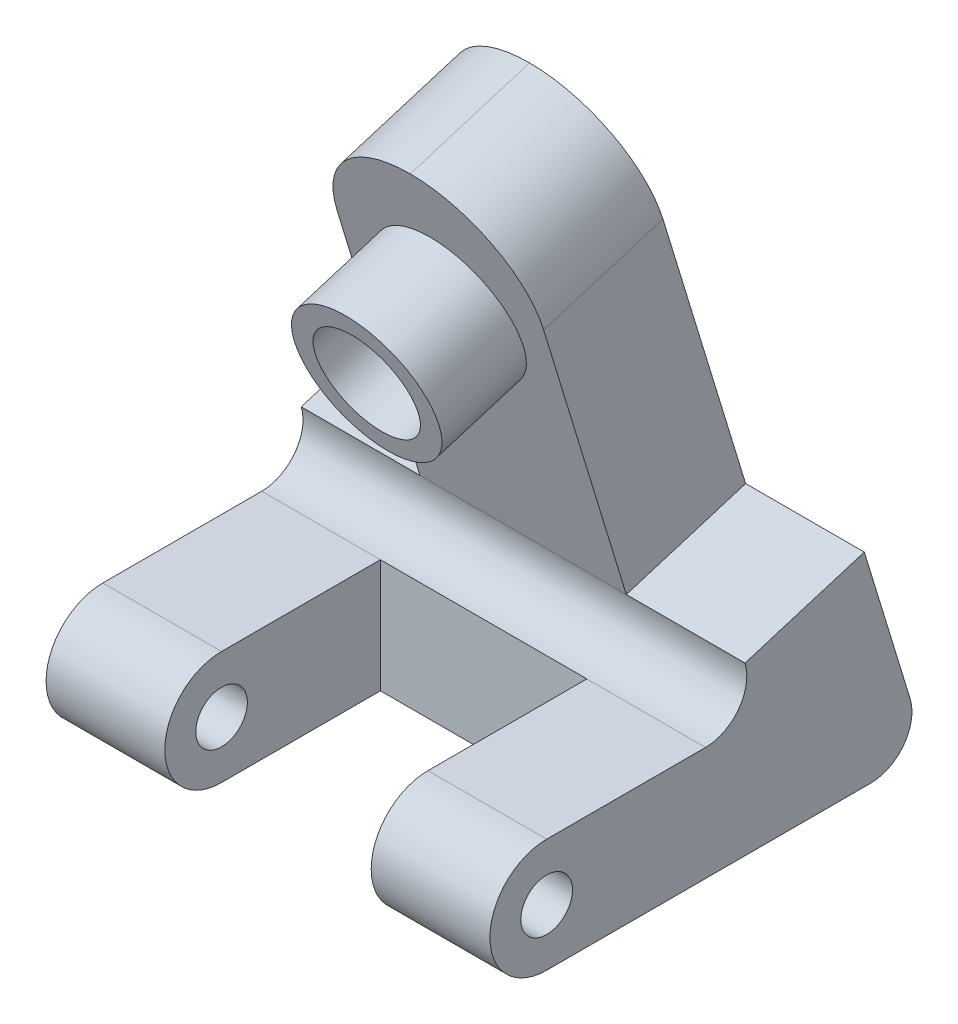
ISO-10303-21;
HEADER;
FILE_DESCRIPTION(('STEP AP214'),'2;1');
FILE_NAME('part.step','',(''),(''),'','','');
FILE_SCHEMA(('AUTOMOTIVE_DESIGN { 1 0 10303 214 1 1 1 1 }'));
ENDSEC;
DATA;
#1=APPLICATION_CONTEXT('core data for automotive mechanical design processes');
#2=APPLICATION_PROTOCOL_DEFINITION('international standard','automotive_design',2000,#1);
#3=PRODUCT_CONTEXT('',#1,'mechanical');
#4=PRODUCT('Part','Part','',(#3));
#5=PRODUCT_RELATED_PRODUCT_CATEGORY('part','',(#4));
#6=PRODUCT_DEFINITION_FORMATION('','',#4);
#7=PRODUCT_DEFINITION_CONTEXT('part definition',#1,'design');
#8=PRODUCT_DEFINITION('design','',#6,#7);
#9=PRODUCT_DEFINITION_SHAPE('','',#8);
#10=(LENGTH_UNIT() NAMED_UNIT(*) SI_UNIT(.MILLI.,.METRE.));
#11=(NAMED_UNIT(*) PLANE_ANGLE_UNIT() SI_UNIT($,.RADIAN.));
#12=(NAMED_UNIT(*) SI_UNIT($,.STERADIAN.) SOLID_ANGLE_UNIT());
#13=UNCERTAINTY_MEASURE_WITH_UNIT(LENGTH_MEASURE(1.E-05),#10,'distance_accuracy_value','');
#14=(GEOMETRIC_REPRESENTATION_CONTEXT(3) GLOBAL_UNCERTAINTY_ASSIGNED_CONTEXT((#13)) GLOBAL_UNIT_ASSIGNED_CONTEXT((#10,
#11,#12)) REPRESENTATION_CONTEXT('',''));
#15=CARTESIAN_POINT('',(0.,0.,0.));
#16=DIRECTION('',(0.,0.,1.));
#17=DIRECTION('',(1.,0.,0.));
#18=AXIS2_PLACEMENT_3D('',#15,#16,#17);
#19=CARTESIAN_POINT('',(20.0025,6.77512412999574,-30.4784538193964));
#20=DIRECTION('',(1.,0.,0.));
#21=DIRECTION('',(0.,0.,-1.));
#22=AXIS2_PLACEMENT_3D('',#19,#20,#21);
#23=PLANE('',#22);
#24=CARTESIAN_POINT('',(20.0025,0.,0.));
#25=DIRECTION('',(1.,0.,0.));
#26=DIRECTION('',(0.,0.,-1.));
#27=AXIS2_PLACEMENT_3D('',#24,#25,#26);
#28=CIRCLE('',#27,1.5875);
#29=CARTESIAN_POINT('',(20.0025,0.,-1.5875));
#30=VERTEX_POINT('',#29);
#31=EDGE_CURVE('E262',#30,#30,#28,.T.);
#32=ORIENTED_EDGE('',*,*,#31,.T.);
#33=EDGE_LOOP('',(#32));
#34=FACE_BOUND('',#33,.T.);
#35=DIRECTION('',(0.,1.,0.));
#36=VECTOR('',#35,1.);
#37=CARTESIAN_POINT('',(20.0025,3.4925,-9.77538700761766));
#38=LINE('',#37,#36);
#39=CARTESIAN_POINT('',(20.0025,-3.4925,-9.77538700761767));
#40=VERTEX_POINT('',#39);
#41=CARTESIAN_POINT('',(20.0025,3.4925,-9.77538700761766));
#42=VERTEX_POINT('',#41);
#43=EDGE_CURVE('E175',#40,#42,#38,.T.);
#44=ORIENTED_EDGE('',*,*,#43,.F.);
#45=DIRECTION('',(0.,0.,1.));
#46=VECTOR('',#45,1.);
#47=CARTESIAN_POINT('',(20.0025,-3.4925,-30.4784538193964));
#48=LINE('',#47,#46);
#49=CARTESIAN_POINT('',(20.0025,-3.4925,0.));
#50=VERTEX_POINT('',#49);
#51=EDGE_CURVE('E165',#40,#50,#48,.T.);
#52=ORIENTED_EDGE('',*,*,#51,.T.);
#53=CARTESIAN_POINT('',(20.0025,0.,0.));
#54=DIRECTION('',(1.,0.,0.));
#55=DIRECTION('',(0.,0.,-1.));
#56=AXIS2_PLACEMENT_3D('',#53,#54,#55);
#57=CIRCLE('',#56,3.4925);
#58=CARTESIAN_POINT('',(20.0025,3.4925,0.));
#59=VERTEX_POINT('',#58);
#60=EDGE_CURVE('E258',#59,#50,#57,.T.);
#61=ORIENTED_EDGE('',*,*,#60,.F.);
#62=DIRECTION('',(0.,0.,1.));
#63=VECTOR('',#62,1.);
#64=CARTESIAN_POINT('',(20.0025,3.4925,0.));
#65=LINE('',#64,#63);
#66=EDGE_CURVE('E254',#42,#59,#65,.T.);
#67=ORIENTED_EDGE('',*,*,#66,.F.);
#68=EDGE_LOOP('',(#44,#52,#61,#67));
#69=FACE_BOUND('',#68,.T.);
#70=ADVANCED_FACE('F43',(#34,#69),#23,.F.);
#71=CARTESIAN_POINT('',(7.3025,6.77512412999574,-30.4784538193964));
#72=DIRECTION('',(-1.,0.,0.));
#73=DIRECTION('',(0.,0.,1.));
#74=AXIS2_PLACEMENT_3D('',#71,#72,#73);
#75=PLANE('',#74);
#76=CARTESIAN_POINT('',(7.3025,0.,0.));
#77=DIRECTION('',(-1.,0.,0.));
#78=DIRECTION('',(0.,0.,1.));
#79=AXIS2_PLACEMENT_3D('',#76,#77,#78);
#80=CIRCLE('',#79,1.5875);
#81=CARTESIAN_POINT('',(7.3025,0.,1.5875));
#82=VERTEX_POINT('',#81);
#83=EDGE_CURVE('E250',#82,#82,#80,.T.);
#84=ORIENTED_EDGE('',*,*,#83,.T.);
#85=EDGE_LOOP('',(#84));
#86=FACE_BOUND('',#85,.T.);
#87=DIRECTION('',(0.,1.,0.));
#88=VECTOR('',#87,1.);
#89=CARTESIAN_POINT('',(7.3025,3.4925,-9.77538700761766));
#90=LINE('',#89,#88);
#91=CARTESIAN_POINT('',(7.3025,-3.4925,-9.77538700761766));
#92=VERTEX_POINT('',#91);
#93=CARTESIAN_POINT('',(7.3025,3.4925,-9.77538700761766));
#94=VERTEX_POINT('',#93);
#95=EDGE_CURVE('E158',#92,#94,#90,.T.);
#96=ORIENTED_EDGE('',*,*,#95,.T.);
#97=DIRECTION('',(0.,0.,-1.));
#98=VECTOR('',#97,1.);
#99=CARTESIAN_POINT('',(7.3025,3.4925,0.));
#100=LINE('',#99,#98);
#101=CARTESIAN_POINT('',(7.3025,3.4925,0.));
#102=VERTEX_POINT('',#101);
#103=EDGE_CURVE('E164',#102,#94,#100,.T.);
#104=ORIENTED_EDGE('',*,*,#103,.F.);
#105=CARTESIAN_POINT('',(7.3025,0.,0.));
#106=DIRECTION('',(-1.,0.,0.));
#107=DIRECTION('',(0.,0.,1.));
#108=AXIS2_PLACEMENT_3D('',#105,#106,#107);
#109=CIRCLE('',#108,3.4925);
#110=CARTESIAN_POINT('',(7.3025,-3.4925,0.));
#111=VERTEX_POINT('',#110);
#112=EDGE_CURVE('E160',#111,#102,#109,.T.);
#113=ORIENTED_EDGE('',*,*,#112,.F.);
#114=DIRECTION('',(0.,0.,1.));
#115=VECTOR('',#114,1.);
#116=CARTESIAN_POINT('',(7.3025,-3.4925,-30.4784538193964));
#117=LINE('',#116,#115);
#118=EDGE_CURVE('E153',#92,#111,#117,.T.);
#119=ORIENTED_EDGE('',*,*,#118,.F.);
#120=EDGE_LOOP('',(#96,#104,#113,#119));
#121=FACE_BOUND('',#120,.T.);
#122=ADVANCED_FACE('F155',(#86,#121),#75,.F.);
#123=CARTESIAN_POINT('',(27.305,3.4925,-13.208));
#124=DIRECTION('',(0.,0.292371704722731,-0.956304755963037));
#125=DIRECTION('',(0.,0.956304755963037,0.292371704722731));
#126=AXIS2_PLACEMENT_3D('',#123,#124,#125);
#127=PLANE('',#126);
#128=CARTESIAN_POINT('',(13.6525,21.2566992799276,-7.77693924858039));
#129=DIRECTION('',(0.,0.292371704722731,-0.956304755963037));
#130=DIRECTION('',(0.,0.956304755963037,0.292371704722731));
#131=AXIS2_PLACEMENT_3D('',#128,#129,#130);
#132=CIRCLE('',#131,4.44499999999998);
#133=CARTESIAN_POINT('',(13.6525,25.5074739201833,-6.47734702108786));
#134=VERTEX_POINT('',#133);
#135=EDGE_CURVE('E344',#134,#134,#132,.F.);
#136=ORIENTED_EDGE('',*,*,#135,.F.);
#137=EDGE_LOOP('',(#136));
#138=FACE_BOUND('',#137,.T.);
#139=DIRECTION('',(0.,0.956304755963037,0.292371704722731));
#140=VECTOR('',#139,1.);
#141=CARTESIAN_POINT('',(20.0025,29.4845904903388,-5.26142046185372));
#142=LINE('',#141,#140);
#143=CARTESIAN_POINT('',(20.0025,6.77512412999574,-12.2044010877638));
#144=VERTEX_POINT('',#143);
#145=CARTESIAN_POINT('',(20.0025,23.4120552899735,-7.11798078684306));
#146=VERTEX_POINT('',#145);
#147=EDGE_CURVE('E195',#144,#146,#142,.T.);
#148=ORIENTED_EDGE('',*,*,#147,.T.);
#149=CARTESIAN_POINT('',(13.6525,23.4120552899735,-7.11798078684306));
#150=DIRECTION('',(0.,0.292371704722731,-0.956304755963037));
#151=DIRECTION('',(0.,0.956304755963037,0.292371704722731));
#152=AXIS2_PLACEMENT_3D('',#149,#150,#151);
#153=CIRCLE('',#152,6.35);
#154=CARTESIAN_POINT('',(13.6525,29.4845904903388,-5.26142046185372));
#155=VERTEX_POINT('',#154);
#156=EDGE_CURVE('E53',#146,#155,#153,.F.);
#157=ORIENTED_EDGE('',*,*,#156,.T.);
#158=CARTESIAN_POINT('',(13.6525,23.4120552899735,-7.11798078684306));
#159=DIRECTION('',(0.,0.292371704722731,-0.956304755963037));
#160=DIRECTION('',(0.,0.956304755963037,0.292371704722731));
#161=AXIS2_PLACEMENT_3D('',#158,#159,#160);
#162=CIRCLE('',#161,6.35);
#163=CARTESIAN_POINT('',(7.3025,23.4120552899735,-7.11798078684306));
#164=VERTEX_POINT('',#163);
#165=EDGE_CURVE('E63',#155,#164,#162,.F.);
#166=ORIENTED_EDGE('',*,*,#165,.T.);
#167=DIRECTION('',(0.,-0.956304755963037,-0.292371704722731));
#168=VECTOR('',#167,1.);
#169=CARTESIAN_POINT('',(7.3025,29.4845904903388,-5.26142046185372));
#170=LINE('',#169,#168);
#171=CARTESIAN_POINT('',(7.3025,6.77512412999574,-12.2044010877638));
#172=VERTEX_POINT('',#171);
#173=EDGE_CURVE('E209',#164,#172,#170,.T.);
#174=ORIENTED_EDGE('',*,*,#173,.T.);
#175=DIRECTION('',(1.,0.,0.));
#176=VECTOR('',#175,1.);
#177=CARTESIAN_POINT('',(-4.37775292560834,6.77512412999574,-12.2044010877638));
#178=LINE('',#177,#176);
#179=EDGE_CURVE('E176',#172,#144,#178,.T.);
#180=ORIENTED_EDGE('',*,*,#179,.T.);
#181=EDGE_LOOP('',(#148,#157,#166,#174,#180));
#182=FACE_BOUND('',#181,.T.);
#183=ADVANCED_FACE('F426',(#138,#182),#127,.F.);
#184=CARTESIAN_POINT('',(27.305,0.,0.));
#185=DIRECTION('',(-1.,0.,0.));
#186=DIRECTION('',(0.,0.,1.));
#187=AXIS2_PLACEMENT_3D('',#184,#185,#186);
#188=CYLINDRICAL_SURFACE('',#187,3.4925);
#189=ORIENTED_EDGE('',*,*,#112,.T.);
#190=DIRECTION('',(-1.,0.,0.));
#191=VECTOR('',#190,1.);
#192=CARTESIAN_POINT('',(27.305,3.4925,0.));
#193=LINE('',#192,#191);
#194=CARTESIAN_POINT('',(0.,3.4925,0.));
#195=VERTEX_POINT('',#194);
#196=EDGE_CURVE('E291',#102,#195,#193,.T.);
#197=ORIENTED_EDGE('',*,*,#196,.T.);
#198=CARTESIAN_POINT('',(0.,0.,0.));
#199=DIRECTION('',(1.,0.,0.));
#200=DIRECTION('',(0.,0.,-1.));
#201=AXIS2_PLACEMENT_3D('',#198,#199,#200);
#202=CIRCLE('',#201,3.4925);
#203=CARTESIAN_POINT('',(0.,-3.4925,0.));
#204=VERTEX_POINT('',#203);
#205=EDGE_CURVE('E271',#195,#204,#202,.T.);
#206=ORIENTED_EDGE('',*,*,#205,.T.);
#207=DIRECTION('',(-1.,0.,0.));
#208=VECTOR('',#207,1.);
#209=CARTESIAN_POINT('',(27.305,-3.4925,0.));
#210=LINE('',#209,#208);
#211=EDGE_CURVE('E310',#111,#204,#210,.T.);
#212=ORIENTED_EDGE('',*,*,#211,.F.);
#213=EDGE_LOOP('',(#189,#197,#206,#212));
#214=FACE_BOUND('',#213,.T.);
#215=ADVANCED_FACE('F367',(#214),#188,.T.);
#216=CARTESIAN_POINT('',(27.305,3.4925,0.));
#217=DIRECTION('',(0.,-1.,0.));
#218=DIRECTION('',(0.,0.,-1.));
#219=AXIS2_PLACEMENT_3D('',#216,#217,#218);
#220=PLANE('',#219);
#221=DIRECTION('',(-1.,0.,0.));
#222=VECTOR('',#221,1.);
#223=CARTESIAN_POINT('',(0.,3.4925,-9.77538700761766));
#224=LINE('',#223,#222);
#225=CARTESIAN_POINT('',(27.305,3.4925,-9.77538700761766));
#226=VERTEX_POINT('',#225);
#227=EDGE_CURVE('E315',#226,#42,#224,.T.);
#228=ORIENTED_EDGE('',*,*,#227,.T.);
#229=ORIENTED_EDGE('',*,*,#66,.T.);
#230=CARTESIAN_POINT('',(27.305,3.4925,0.));
#231=VERTEX_POINT('',#230);
#232=EDGE_CURVE('E306',#231,#59,#193,.T.);
#233=ORIENTED_EDGE('',*,*,#232,.F.);
#234=DIRECTION('',(0.,0.,1.));
#235=VECTOR('',#234,1.);
#236=CARTESIAN_POINT('',(27.305,3.4925,0.));
#237=LINE('',#236,#235);
#238=EDGE_CURVE('E288',#226,#231,#237,.T.);
#239=ORIENTED_EDGE('',*,*,#238,.F.);
#240=EDGE_LOOP('',(#228,#229,#233,#239));
#241=FACE_BOUND('',#240,.T.);
#242=ADVANCED_FACE('F410',(#241),#220,.F.);
#243=CARTESIAN_POINT('',(27.305,0.,0.));
#244=DIRECTION('',(-1.,0.,0.));
#245=DIRECTION('',(0.,0.,1.));
#246=AXIS2_PLACEMENT_3D('',#243,#244,#245);
#247=CYLINDRICAL_SURFACE('',#246,1.5875);
#248=ORIENTED_EDGE('',*,*,#31,.F.);
#249=EDGE_LOOP('',(#248));
#250=FACE_BOUND('',#249,.T.);
#251=CARTESIAN_POINT('',(27.305,0.,0.));
#252=DIRECTION('',(1.,0.,0.));
#253=DIRECTION('',(0.,0.,-1.));
#254=AXIS2_PLACEMENT_3D('',#251,#252,#253);
#255=CIRCLE('',#254,1.5875);
#256=CARTESIAN_POINT('',(27.305,0.,-1.5875));
#257=VERTEX_POINT('',#256);
#258=EDGE_CURVE('E267',#257,#257,#255,.T.);
#259=ORIENTED_EDGE('',*,*,#258,.T.);
#260=EDGE_LOOP('',(#259));
#261=FACE_BOUND('',#260,.T.);
#262=ADVANCED_FACE('F441',(#250,#261),#247,.F.);
#263=CARTESIAN_POINT('',(27.305,0.,0.));
#264=DIRECTION('',(1.,0.,0.));
#265=DIRECTION('',(0.,0.,-1.));
#266=AXIS2_PLACEMENT_3D('',#263,#264,#265);
#267=PLANE('',#266);
#268=DIRECTION('',(0.,0.292371704722731,-0.956304755963037));
#269=VECTOR('',#268,1.);
#270=CARTESIAN_POINT('',(27.305,6.77512412999574,-12.2044010877638));
#271=LINE('',#270,#269);
#272=CARTESIAN_POINT('',(27.305,6.77512412999574,-12.2044010877638));
#273=VERTEX_POINT('',#272);
#274=CARTESIAN_POINT('',(27.305,9.01873780177559,-19.5429307409719));
#275=VERTEX_POINT('',#274);
#276=EDGE_CURVE('E183',#273,#275,#271,.T.);
#277=ORIENTED_EDGE('',*,*,#276,.F.);
#278=CARTESIAN_POINT('',(27.305,6.0325,-9.77538700761766));
#279=DIRECTION('',(1.,0.,0.));
#280=DIRECTION('',(0.,0.,-1.));
#281=AXIS2_PLACEMENT_3D('',#278,#279,#280);
#282=CIRCLE('',#281,2.54);
#283=EDGE_CURVE('E341',#273,#226,#282,.F.);
#284=ORIENTED_EDGE('',*,*,#283,.T.);
#285=ORIENTED_EDGE('',*,*,#238,.T.);
#286=CARTESIAN_POINT('',(27.305,0.,0.));
#287=DIRECTION('',(1.,0.,0.));
#288=DIRECTION('',(0.,0.,-1.));
#289=AXIS2_PLACEMENT_3D('',#286,#287,#288);
#290=CIRCLE('',#289,3.4925);
#291=CARTESIAN_POINT('',(27.305,-3.4925,0.));
#292=VERTEX_POINT('',#291);
#293=EDGE_CURVE('E275',#231,#292,#290,.T.);
#294=ORIENTED_EDGE('',*,*,#293,.T.);
#295=DIRECTION('',(0.,0.,-1.));
#296=VECTOR('',#295,1.);
#297=CARTESIAN_POINT('',(27.305,-3.4925,0.));
#298=LINE('',#297,#296);
#299=CARTESIAN_POINT('',(27.305,-3.4925,-19.9353870076177));
#300=VERTEX_POINT('',#299);
#301=EDGE_CURVE('E279',#292,#300,#298,.T.);
#302=ORIENTED_EDGE('',*,*,#301,.T.);
#303=CARTESIAN_POINT('',(27.305,-0.9525,-19.9353870076177));
#304=DIRECTION('',(1.,0.,0.));
#305=DIRECTION('',(0.,0.,-1.));
#306=AXIS2_PLACEMENT_3D('',#303,#304,#305);
#307=CIRCLE('',#306,2.54);
#308=CARTESIAN_POINT('',(27.305,-0.209875870004263,-22.3644010877638));
#309=VERTEX_POINT('',#308);
#310=EDGE_CURVE('E334',#300,#309,#307,.T.);
#311=ORIENTED_EDGE('',*,*,#310,.T.);
#312=DIRECTION('',(0.,0.956304755963037,0.292371704722731));
#313=VECTOR('',#312,1.);
#314=CARTESIAN_POINT('',(27.305,-3.4925,-23.368));
#315=LINE('',#314,#313);
#316=EDGE_CURVE('E284',#309,#275,#315,.T.);
#317=ORIENTED_EDGE('',*,*,#316,.T.);
#318=EDGE_LOOP('',(#277,#284,#285,#294,#302,#311,#317));
#319=FACE_BOUND('',#318,.T.);
#320=ORIENTED_EDGE('',*,*,#258,.F.);
#321=EDGE_LOOP('',(#320));
#322=FACE_BOUND('',#321,.T.);
#323=ADVANCED_FACE('F387',(#319,#322),#267,.T.);
#324=CARTESIAN_POINT('',(0.,0.,0.));
#325=DIRECTION('',(1.,0.,0.));
#326=DIRECTION('',(0.,0.,-1.));
#327=AXIS2_PLACEMENT_3D('',#324,#325,#326);
#328=PLANE('',#327);
#329=CARTESIAN_POINT('',(0.,6.0325,-9.77538700761766));
#330=DIRECTION('',(1.,0.,0.));
#331=DIRECTION('',(0.,0.,-1.));
#332=AXIS2_PLACEMENT_3D('',#329,#330,#331);
#333=CIRCLE('',#332,2.54);
#334=CARTESIAN_POINT('',(0.,3.4925,-9.77538700761766));
#335=VERTEX_POINT('',#334);
#336=CARTESIAN_POINT('',(0.,6.77512412999574,-12.2044010877638));
#337=VERTEX_POINT('',#336);
#338=EDGE_CURVE('E337',#335,#337,#333,.T.);
#339=ORIENTED_EDGE('',*,*,#338,.T.);
#340=DIRECTION('',(0.,-0.292371704722731,0.956304755963037));
#341=VECTOR('',#340,1.);
#342=CARTESIAN_POINT('',(0.,6.77512412999574,-12.2044010877638));
#343=LINE('',#342,#341);
#344=CARTESIAN_POINT('',(0.,9.01873780177559,-19.5429307409719));
#345=VERTEX_POINT('',#344);
#346=EDGE_CURVE('E204',#345,#337,#343,.T.);
#347=ORIENTED_EDGE('',*,*,#346,.F.);
#348=DIRECTION('',(0.,0.956304755963037,0.292371704722731));
#349=VECTOR('',#348,1.);
#350=CARTESIAN_POINT('',(0.,-3.4925,-23.368));
#351=LINE('',#350,#349);
#352=CARTESIAN_POINT('',(0.,-0.209875870004263,-22.3644010877638));
#353=VERTEX_POINT('',#352);
#354=EDGE_CURVE('E299',#353,#345,#351,.T.);
#355=ORIENTED_EDGE('',*,*,#354,.F.);
#356=CARTESIAN_POINT('',(0.,-0.9525,-19.9353870076177));
#357=DIRECTION('',(1.,0.,0.));
#358=DIRECTION('',(0.,0.,-1.));
#359=AXIS2_PLACEMENT_3D('',#356,#357,#358);
#360=CIRCLE('',#359,2.54);
#361=CARTESIAN_POINT('',(0.,-3.4925,-19.9353870076177));
#362=VERTEX_POINT('',#361);
#363=EDGE_CURVE('E328',#353,#362,#360,.F.);
#364=ORIENTED_EDGE('',*,*,#363,.T.);
#365=DIRECTION('',(0.,0.,-1.));
#366=VECTOR('',#365,1.);
#367=CARTESIAN_POINT('',(0.,-3.4925,0.));
#368=LINE('',#367,#366);
#369=EDGE_CURVE('E295',#204,#362,#368,.T.);
#370=ORIENTED_EDGE('',*,*,#369,.F.);
#371=ORIENTED_EDGE('',*,*,#205,.F.);
#372=DIRECTION('',(0.,0.,1.));
#373=VECTOR('',#372,1.);
#374=CARTESIAN_POINT('',(0.,3.4925,0.));
#375=LINE('',#374,#373);
#376=EDGE_CURVE('E280',#335,#195,#375,.T.);
#377=ORIENTED_EDGE('',*,*,#376,.F.);
#378=EDGE_LOOP('',(#339,#347,#355,#364,#370,#371,#377));
#379=FACE_BOUND('',#378,.T.);
#380=CARTESIAN_POINT('',(0.,0.,0.));
#381=DIRECTION('',(1.,0.,0.));
#382=DIRECTION('',(0.,0.,-1.));
#383=AXIS2_PLACEMENT_3D('',#380,#381,#382);
#384=CIRCLE('',#383,1.5875);
#385=CARTESIAN_POINT('',(0.,0.,-1.5875));
#386=VERTEX_POINT('',#385);
#387=EDGE_CURVE('E266',#386,#386,#384,.T.);
#388=ORIENTED_EDGE('',*,*,#387,.T.);
#389=EDGE_LOOP('',(#388));
#390=FACE_BOUND('',#389,.T.);
#391=ADVANCED_FACE('F376',(#379,#390),#328,.F.);
#392=ORIENTED_EDGE('',*,*,#60,.T.);
#393=EDGE_CURVE('E311',#292,#50,#210,.T.);
#394=ORIENTED_EDGE('',*,*,#393,.F.);
#395=ORIENTED_EDGE('',*,*,#293,.F.);
#396=ORIENTED_EDGE('',*,*,#232,.T.);
#397=EDGE_LOOP('',(#392,#394,#395,#396));
#398=FACE_BOUND('',#397,.T.);
#399=ADVANCED_FACE('F414',(#398),#188,.T.);
#400=CARTESIAN_POINT('',(27.305,-3.4925,0.));
#401=DIRECTION('',(0.,1.,0.));
#402=DIRECTION('',(0.,0.,1.));
#403=AXIS2_PLACEMENT_3D('',#400,#401,#402);
#404=PLANE('',#403);
#405=ORIENTED_EDGE('',*,*,#51,.F.);
#406=DIRECTION('',(1.,0.,0.));
#407=VECTOR('',#406,1.);
#408=CARTESIAN_POINT('',(-4.37775292560834,-3.4925,-9.77538700761766));
#409=LINE('',#408,#407);
#410=EDGE_CURVE('E169',#92,#40,#409,.T.);
#411=ORIENTED_EDGE('',*,*,#410,.F.);
#412=ORIENTED_EDGE('',*,*,#118,.T.);
#413=ORIENTED_EDGE('',*,*,#211,.T.);
#414=ORIENTED_EDGE('',*,*,#369,.T.);
#415=DIRECTION('',(-1.,0.,0.));
#416=VECTOR('',#415,1.);
#417=CARTESIAN_POINT('',(27.305,-3.4925,-19.9353870076177));
#418=LINE('',#417,#416);
#419=EDGE_CURVE('E331',#362,#300,#418,.F.);
#420=ORIENTED_EDGE('',*,*,#419,.T.);
#421=ORIENTED_EDGE('',*,*,#301,.F.);
#422=ORIENTED_EDGE('',*,*,#393,.T.);
#423=EDGE_LOOP('',(#405,#411,#412,#413,#414,#420,#421,#422));
#424=FACE_BOUND('',#423,.T.);
#425=ADVANCED_FACE('F170',(#424),#404,.F.);
#426=CARTESIAN_POINT('',(27.305,-3.4925,-23.368));
#427=DIRECTION('',(0.,-0.292371704722731,0.956304755963037));
#428=DIRECTION('',(0.,-0.956304755963037,-0.292371704722731));
#429=AXIS2_PLACEMENT_3D('',#426,#427,#428);
#430=PLANE('',#429);
#431=CARTESIAN_POINT('',(13.6525,23.5003129517075,-15.1154689017885));
#432=DIRECTION('',(0.,-0.292371704722731,0.956304755963037));
#433=DIRECTION('',(0.,-0.956304755963037,-0.292371704722731));
#434=AXIS2_PLACEMENT_3D('',#431,#432,#433);
#435=CIRCLE('',#434,3.4925);
#436=CARTESIAN_POINT('',(13.6525,20.1604185915066,-16.1365770805326));
#437=VERTEX_POINT('',#436);
#438=EDGE_CURVE('E228',#437,#437,#435,.F.);
#439=ORIENTED_EDGE('',*,*,#438,.F.);
#440=EDGE_LOOP('',(#439));
#441=FACE_BOUND('',#440,.T.);
#442=CARTESIAN_POINT('',(13.6525,25.6556689617534,-14.4565104400512));
#443=DIRECTION('',(0.,-0.292371704722731,0.956304755963037));
#444=DIRECTION('',(0.,-0.956304755963037,-0.292371704722731));
#445=AXIS2_PLACEMENT_3D('',#442,#443,#444);
#446=CIRCLE('',#445,6.35);
#447=CARTESIAN_POINT('',(7.3025,25.6556689617534,-14.4565104400512));
#448=VERTEX_POINT('',#447);
#449=CARTESIAN_POINT('',(13.6525,31.7282041621186,-12.5999501150618));
#450=VERTEX_POINT('',#449);
#451=EDGE_CURVE('E348',#448,#450,#446,.F.);
#452=ORIENTED_EDGE('',*,*,#451,.T.);
#453=CARTESIAN_POINT('',(13.6525,25.6556689617534,-14.4565104400512));
#454=DIRECTION('',(0.,-0.292371704722731,0.956304755963037));
#455=DIRECTION('',(0.,-0.956304755963037,-0.292371704722731));
#456=AXIS2_PLACEMENT_3D('',#453,#454,#455);
#457=CIRCLE('',#456,6.35);
#458=CARTESIAN_POINT('',(20.0025,25.6556689617534,-14.4565104400512));
#459=VERTEX_POINT('',#458);
#460=EDGE_CURVE('E351',#450,#459,#457,.F.);
#461=ORIENTED_EDGE('',*,*,#460,.T.);
#462=DIRECTION('',(0.,-0.956304755963037,-0.292371704722731));
#463=VECTOR('',#462,1.);
#464=CARTESIAN_POINT('',(20.0025,9.01873780177559,-19.5429307409719));
#465=LINE('',#464,#463);
#466=CARTESIAN_POINT('',(20.0025,9.01873780177558,-19.5429307409719));
#467=VERTEX_POINT('',#466);
#468=EDGE_CURVE('E202',#459,#467,#465,.T.);
#469=ORIENTED_EDGE('',*,*,#468,.T.);
#470=DIRECTION('',(1.,0.,0.));
#471=VECTOR('',#470,1.);
#472=CARTESIAN_POINT('',(-8.7484606612038,9.01873780177559,-19.5429307409719));
#473=LINE('',#472,#471);
#474=EDGE_CURVE('E187',#467,#275,#473,.T.);
#475=ORIENTED_EDGE('',*,*,#474,.T.);
#476=ORIENTED_EDGE('',*,*,#316,.F.);
#477=DIRECTION('',(-1.,0.,0.));
#478=VECTOR('',#477,1.);
#479=CARTESIAN_POINT('',(27.305,-0.209875870004264,-22.3644010877638));
#480=LINE('',#479,#478);
#481=EDGE_CURVE('E324',#309,#353,#480,.T.);
#482=ORIENTED_EDGE('',*,*,#481,.T.);
#483=ORIENTED_EDGE('',*,*,#354,.T.);
#484=DIRECTION('',(-1.,0.,0.));
#485=VECTOR('',#484,1.);
#486=CARTESIAN_POINT('',(36.0534606612038,9.01873780177559,-19.5429307409719));
#487=LINE('',#486,#485);
#488=CARTESIAN_POINT('',(7.3025,9.01873780177559,-19.5429307409719));
#489=VERTEX_POINT('',#488);
#490=EDGE_CURVE('E213',#489,#345,#487,.T.);
#491=ORIENTED_EDGE('',*,*,#490,.F.);
#492=DIRECTION('',(0.,0.956304755963037,0.292371704722731));
#493=VECTOR('',#492,1.);
#494=CARTESIAN_POINT('',(7.3025,9.01873780177559,-19.5429307409719));
#495=LINE('',#494,#493);
#496=EDGE_CURVE('E212',#489,#448,#495,.T.);
#497=ORIENTED_EDGE('',*,*,#496,.T.);
#498=EDGE_LOOP('',(#452,#461,#469,#475,#476,#482,#483,#491,#497));
#499=FACE_BOUND('',#498,.T.);
#500=ADVANCED_FACE('F390',(#441,#499),#430,.F.);
#501=ORIENTED_EDGE('',*,*,#196,.F.);
#502=ORIENTED_EDGE('',*,*,#103,.T.);
#503=EDGE_CURVE('E314',#94,#335,#224,.T.);
#504=ORIENTED_EDGE('',*,*,#503,.T.);
#505=ORIENTED_EDGE('',*,*,#376,.T.);
#506=EDGE_LOOP('',(#501,#502,#504,#505));
#507=FACE_BOUND('',#506,.T.);
#508=ADVANCED_FACE('F371',(#507),#220,.F.);
#509=ORIENTED_EDGE('',*,*,#83,.F.);
#510=EDGE_LOOP('',(#509));
#511=FACE_BOUND('',#510,.T.);
#512=ORIENTED_EDGE('',*,*,#387,.F.);
#513=EDGE_LOOP('',(#512));
#514=FACE_BOUND('',#513,.T.);
#515=ADVANCED_FACE('F437',(#511,#514),#247,.F.);
#516=CARTESIAN_POINT('',(27.305,6.0325,-9.77538700761766));
#517=DIRECTION('',(1.,0.,0.));
#518=DIRECTION('',(0.,0.,-1.));
#519=AXIS2_PLACEMENT_3D('',#516,#517,#518);
#520=CYLINDRICAL_SURFACE('',#519,2.54);
#521=ORIENTED_EDGE('',*,*,#503,.F.);
#522=DIRECTION('',(1.,0.,0.));
#523=VECTOR('',#522,1.);
#524=CARTESIAN_POINT('',(-4.37775292560834,3.4925,-9.77538700761766));
#525=LINE('',#524,#523);
#526=EDGE_CURVE('E181',#94,#42,#525,.T.);
#527=ORIENTED_EDGE('',*,*,#526,.T.);
#528=ORIENTED_EDGE('',*,*,#227,.F.);
#529=ORIENTED_EDGE('',*,*,#283,.F.);
#530=DIRECTION('',(-1.,0.,0.));
#531=VECTOR('',#530,1.);
#532=CARTESIAN_POINT('',(27.305,6.77512412999574,-12.2044010877638));
#533=LINE('',#532,#531);
#534=EDGE_CURVE('E319',#144,#273,#533,.F.);
#535=ORIENTED_EDGE('',*,*,#534,.F.);
#536=ORIENTED_EDGE('',*,*,#179,.F.);
#537=EDGE_CURVE('E320',#337,#172,#533,.F.);
#538=ORIENTED_EDGE('',*,*,#537,.F.);
#539=ORIENTED_EDGE('',*,*,#338,.F.);
#540=EDGE_LOOP('',(#521,#527,#528,#529,#535,#536,#538,#539));
#541=FACE_BOUND('',#540,.T.);
#542=ADVANCED_FACE('F404',(#541),#520,.F.);
#543=CARTESIAN_POINT('',(27.305,-0.9525,-19.9353870076177));
#544=DIRECTION('',(-1.,0.,0.));
#545=DIRECTION('',(0.,0.,1.));
#546=AXIS2_PLACEMENT_3D('',#543,#544,#545);
#547=CYLINDRICAL_SURFACE('',#546,2.54);
#548=ORIENTED_EDGE('',*,*,#310,.F.);
#549=ORIENTED_EDGE('',*,*,#419,.F.);
#550=ORIENTED_EDGE('',*,*,#363,.F.);
#551=ORIENTED_EDGE('',*,*,#481,.F.);
#552=EDGE_LOOP('',(#548,#549,#550,#551));
#553=FACE_BOUND('',#552,.T.);
#554=ADVANCED_FACE('F382',(#553),#547,.T.);
#555=CARTESIAN_POINT('',(13.6525,19.6680244729563,-2.58061809627826));
#556=DIRECTION('',(0.,-0.292371704722731,0.956304755963037));
#557=DIRECTION('',(0.,-0.956304755963037,-0.292371704722731));
#558=AXIS2_PLACEMENT_3D('',#555,#556,#557);
#559=PLANE('',#558);
#560=CARTESIAN_POINT('',(13.6525,19.6680244729563,-2.58061809627826));
#561=DIRECTION('',(0.,-0.292371704722731,0.956304755963037));
#562=DIRECTION('',(0.,-0.956304755963037,-0.292371704722731));
#563=AXIS2_PLACEMENT_3D('',#560,#561,#562);
#564=CIRCLE('',#563,4.44499999999998);
#565=CARTESIAN_POINT('',(13.6525,15.4172498327006,-3.88021032377079));
#566=VERTEX_POINT('',#565);
#567=EDGE_CURVE('E237',#566,#566,#564,.T.);
#568=ORIENTED_EDGE('',*,*,#567,.T.);
#569=EDGE_LOOP('',(#568));
#570=FACE_BOUND('',#569,.T.);
#571=CARTESIAN_POINT('',(13.6525,19.6680244729563,-2.58061809627826));
#572=DIRECTION('',(0.,-0.292371704722731,0.956304755963037));
#573=DIRECTION('',(0.,-0.956304755963037,-0.292371704722731));
#574=AXIS2_PLACEMENT_3D('',#571,#572,#573);
#575=CIRCLE('',#574,3.175);
#576=CARTESIAN_POINT('',(13.6525,16.6317568727737,-3.50889825877293));
#577=VERTEX_POINT('',#576);
#578=EDGE_CURVE('E233',#577,#577,#575,.T.);
#579=ORIENTED_EDGE('',*,*,#578,.F.);
#580=EDGE_LOOP('',(#579));
#581=FACE_BOUND('',#580,.T.);
#582=ADVANCED_FACE('F479',(#570,#581),#559,.T.);
#583=CARTESIAN_POINT('',(13.6525,19.6680244729563,-2.58061809627826));
#584=DIRECTION('',(0.,0.292371704722731,-0.956304755963037));
#585=DIRECTION('',(0.,0.956304755963037,0.292371704722731));
#586=AXIS2_PLACEMENT_3D('',#583,#584,#585);
#587=CYLINDRICAL_SURFACE('',#586,4.44499999999998);
#588=ORIENTED_EDGE('',*,*,#567,.F.);
#589=EDGE_LOOP('',(#588));
#590=FACE_BOUND('',#589,.T.);
#591=ORIENTED_EDGE('',*,*,#135,.T.);
#592=EDGE_LOOP('',(#591));
#593=FACE_BOUND('',#592,.T.);
#594=ADVANCED_FACE('F477',(#590,#593),#587,.T.);
#595=CARTESIAN_POINT('',(13.6525,19.6680244729563,-2.58061809627826));
#596=DIRECTION('',(0.,0.292371704722731,-0.956304755963037));
#597=DIRECTION('',(0.,0.956304755963037,0.292371704722731));
#598=AXIS2_PLACEMENT_3D('',#595,#596,#597);
#599=CYLINDRICAL_SURFACE('',#598,3.175);
#600=ORIENTED_EDGE('',*,*,#578,.T.);
#601=EDGE_LOOP('',(#600));
#602=FACE_BOUND('',#601,.T.);
#603=CARTESIAN_POINT('',(13.6525,21.2566992799276,-7.77693924858039));
#604=DIRECTION('',(0.,-0.292371704722731,0.956304755963037));
#605=DIRECTION('',(0.,-0.956304755963037,-0.292371704722731));
#606=AXIS2_PLACEMENT_3D('',#603,#604,#605);
#607=CIRCLE('',#606,3.175);
#608=CARTESIAN_POINT('',(13.6525,18.220431679745,-8.70521941107507));
#609=VERTEX_POINT('',#608);
#610=EDGE_CURVE('E232',#609,#609,#607,.T.);
#611=ORIENTED_EDGE('',*,*,#610,.F.);
#612=EDGE_LOOP('',(#611));
#613=FACE_BOUND('',#612,.T.);
#614=ADVANCED_FACE('F459',(#602,#613),#599,.F.);
#615=CARTESIAN_POINT('',(13.6525,26.3884430217676,-24.5621167039676));
#616=DIRECTION('',(0.,-0.292371704722731,0.956304755963037));
#617=DIRECTION('',(0.,-0.956304755963037,-0.292371704722731));
#618=AXIS2_PLACEMENT_3D('',#615,#616,#617);
#619=CYLINDRICAL_SURFACE('',#618,3.4925);
#620=ORIENTED_EDGE('',*,*,#438,.T.);
#621=EDGE_LOOP('',(#620));
#622=FACE_BOUND('',#621,.T.);
#623=CARTESIAN_POINT('',(13.6525,21.2566992799277,-7.7769392485804));
#624=DIRECTION('',(0.,-0.292371704722731,0.956304755963037));
#625=DIRECTION('',(0.,-0.956304755963037,-0.292371704722731));
#626=AXIS2_PLACEMENT_3D('',#623,#624,#625);
#627=CIRCLE('',#626,3.4925);
#628=CARTESIAN_POINT('',(13.6525,17.9168049197267,-8.79804742732454));
#629=VERTEX_POINT('',#628);
#630=EDGE_CURVE('E224',#629,#629,#627,.T.);
#631=ORIENTED_EDGE('',*,*,#630,.T.);
#632=EDGE_LOOP('',(#631));
#633=FACE_BOUND('',#632,.T.);
#634=ADVANCED_FACE('F455',(#622,#633),#619,.F.);
#635=CARTESIAN_POINT('',(13.6525,21.2566992799277,-7.7769392485804));
#636=DIRECTION('',(0.,-0.292371704722731,0.956304755963037));
#637=DIRECTION('',(0.,-0.956304755963037,-0.292371704722731));
#638=AXIS2_PLACEMENT_3D('',#635,#636,#637);
#639=PLANE('',#638);
#640=ORIENTED_EDGE('',*,*,#610,.T.);
#641=EDGE_LOOP('',(#640));
#642=FACE_BOUND('',#641,.T.);
#643=ORIENTED_EDGE('',*,*,#630,.F.);
#644=EDGE_LOOP('',(#643));
#645=FACE_BOUND('',#644,.T.);
#646=ADVANCED_FACE('F458',(#642,#645),#639,.F.);
#647=CARTESIAN_POINT('',(36.0534606612038,6.77512412999574,-12.2044010877638));
#648=DIRECTION('',(0.,-0.956304755963037,-0.292371704722731));
#649=DIRECTION('',(0.,0.292371704722731,-0.956304755963037));
#650=AXIS2_PLACEMENT_3D('',#647,#648,#649);
#651=PLANE('',#650);
#652=DIRECTION('',(0.,0.292371704722731,-0.956304755963037));
#653=VECTOR('',#652,1.);
#654=CARTESIAN_POINT('',(7.3025,6.77512412999574,-12.2044010877638));
#655=LINE('',#654,#653);
#656=EDGE_CURVE('E217',#172,#489,#655,.T.);
#657=ORIENTED_EDGE('',*,*,#656,.T.);
#658=ORIENTED_EDGE('',*,*,#490,.T.);
#659=ORIENTED_EDGE('',*,*,#346,.T.);
#660=ORIENTED_EDGE('',*,*,#537,.T.);
#661=EDGE_LOOP('',(#657,#658,#659,#660));
#662=FACE_BOUND('',#661,.T.);
#663=ADVANCED_FACE('F464',(#662),#651,.F.);
#664=CARTESIAN_POINT('',(7.3025,6.77512412999574,-30.4784538193964));
#665=DIRECTION('',(-1.,0.,0.));
#666=DIRECTION('',(0.,0.,1.));
#667=AXIS2_PLACEMENT_3D('',#664,#665,#666);
#668=PLANE('',#667);
#669=ORIENTED_EDGE('',*,*,#173,.F.);
#670=DIRECTION('',(0.,-0.292371704722731,0.956304755963037));
#671=VECTOR('',#670,1.);
#672=CARTESIAN_POINT('',(7.3025,25.6556689617534,-14.4565104400512));
#673=LINE('',#672,#671);
#674=EDGE_CURVE('E11',#164,#448,#673,.F.);
#675=ORIENTED_EDGE('',*,*,#674,.T.);
#676=ORIENTED_EDGE('',*,*,#496,.F.);
#677=ORIENTED_EDGE('',*,*,#656,.F.);
#678=EDGE_LOOP('',(#669,#675,#676,#677));
#679=FACE_BOUND('',#678,.T.);
#680=ADVANCED_FACE('F470',(#679),#668,.T.);
#681=CARTESIAN_POINT('',(-8.7484606612038,6.77512412999574,-12.2044010877638));
#682=DIRECTION('',(0.,-0.956304755963037,-0.292371704722731));
#683=DIRECTION('',(0.,0.292371704722731,-0.956304755963037));
#684=AXIS2_PLACEMENT_3D('',#681,#682,#683);
#685=PLANE('',#684);
#686=DIRECTION('',(0.,-0.292371704722731,0.956304755963037));
#687=VECTOR('',#686,1.);
#688=CARTESIAN_POINT('',(20.0025,6.77512412999574,-12.2044010877638));
#689=LINE('',#688,#687);
#690=EDGE_CURVE('E198',#467,#144,#689,.T.);
#691=ORIENTED_EDGE('',*,*,#690,.T.);
#692=ORIENTED_EDGE('',*,*,#534,.T.);
#693=ORIENTED_EDGE('',*,*,#276,.T.);
#694=ORIENTED_EDGE('',*,*,#474,.F.);
#695=EDGE_LOOP('',(#691,#692,#693,#694));
#696=FACE_BOUND('',#695,.T.);
#697=ADVANCED_FACE('F395',(#696),#685,.F.);
#698=CARTESIAN_POINT('',(20.0025,6.77512412999574,-30.4784538193964));
#699=DIRECTION('',(1.,0.,0.));
#700=DIRECTION('',(0.,0.,-1.));
#701=AXIS2_PLACEMENT_3D('',#698,#699,#700);
#702=PLANE('',#701);
#703=ORIENTED_EDGE('',*,*,#468,.F.);
#704=DIRECTION('',(0.,0.292371704722731,-0.956304755963037));
#705=VECTOR('',#704,1.);
#706=CARTESIAN_POINT('',(20.0025,23.4120552899735,-7.11798078684306));
#707=LINE('',#706,#705);
#708=EDGE_CURVE('E354',#459,#146,#707,.F.);
#709=ORIENTED_EDGE('',*,*,#708,.T.);
#710=ORIENTED_EDGE('',*,*,#147,.F.);
#711=ORIENTED_EDGE('',*,*,#690,.F.);
#712=EDGE_LOOP('',(#703,#709,#710,#711));
#713=FACE_BOUND('',#712,.T.);
#714=ADVANCED_FACE('F398',(#713),#702,.T.);
#715=CARTESIAN_POINT('',(-4.37775292560834,3.4925,-9.77538700761766));
#716=DIRECTION('',(0.,0.,-1.));
#717=DIRECTION('',(0.,1.,0.));
#718=AXIS2_PLACEMENT_3D('',#715,#716,#717);
#719=PLANE('',#718);
#720=ORIENTED_EDGE('',*,*,#95,.F.);
#721=ORIENTED_EDGE('',*,*,#410,.T.);
#722=ORIENTED_EDGE('',*,*,#43,.T.);
#723=ORIENTED_EDGE('',*,*,#526,.F.);
#724=EDGE_LOOP('',(#720,#721,#722,#723));
#725=FACE_BOUND('',#724,.T.);
#726=ADVANCED_FACE('F179',(#725),#719,.F.);
#727=CARTESIAN_POINT('',(13.6525,25.6556689617534,-14.4565104400512));
#728=DIRECTION('',(0.,0.292371704722731,-0.956304755963037));
#729=DIRECTION('',(0.,0.956304755963037,0.292371704722731));
#730=AXIS2_PLACEMENT_3D('',#727,#728,#729);
#731=CYLINDRICAL_SURFACE('',#730,6.35);
#732=ORIENTED_EDGE('',*,*,#674,.F.);
#733=ORIENTED_EDGE('',*,*,#165,.F.);
#734=DIRECTION('',(0.,-0.292371704722731,0.956304755963037));
#735=VECTOR('',#734,1.);
#736=CARTESIAN_POINT('',(13.6525,29.4845904903388,-5.26142046185372));
#737=LINE('',#736,#735);
#738=EDGE_CURVE('E47',#450,#155,#737,.T.);
#739=ORIENTED_EDGE('',*,*,#738,.F.);
#740=ORIENTED_EDGE('',*,*,#451,.F.);
#741=EDGE_LOOP('',(#732,#733,#739,#740));
#742=FACE_BOUND('',#741,.T.);
#743=ADVANCED_FACE('F45',(#742),#731,.T.);
#744=CARTESIAN_POINT('',(13.6525,25.6556689617534,-14.4565104400512));
#745=DIRECTION('',(0.,-0.292371704722731,0.956304755963037));
#746=DIRECTION('',(0.,-0.956304755963037,-0.292371704722731));
#747=AXIS2_PLACEMENT_3D('',#744,#745,#746);
#748=CYLINDRICAL_SURFACE('',#747,6.35);
#749=ORIENTED_EDGE('',*,*,#156,.F.);
#750=ORIENTED_EDGE('',*,*,#708,.F.);
#751=ORIENTED_EDGE('',*,*,#460,.F.);
#752=ORIENTED_EDGE('',*,*,#738,.T.);
#753=EDGE_LOOP('',(#749,#750,#751,#752));
#754=FACE_BOUND('',#753,.T.);
#755=ADVANCED_FACE('F632',(#754),#748,.T.);
#756=CLOSED_SHELL('',(#70,#122,#183,#215,#242,#262,#323,#391,#399,#425,#500,#508,#515,#542,#554,
#582,#594,#614,#634,#646,#663,#680,#697,#714,#726,#743,#755));
#757=MANIFOLD_SOLID_BREP('B2',#756);
#758=ADVANCED_BREP_SHAPE_REPRESENTATION('',(#18,#757),#14);
#759=SHAPE_DEFINITION_REPRESENTATION(#9,#758);
ENDSEC;
END-ISO-10303-21;
